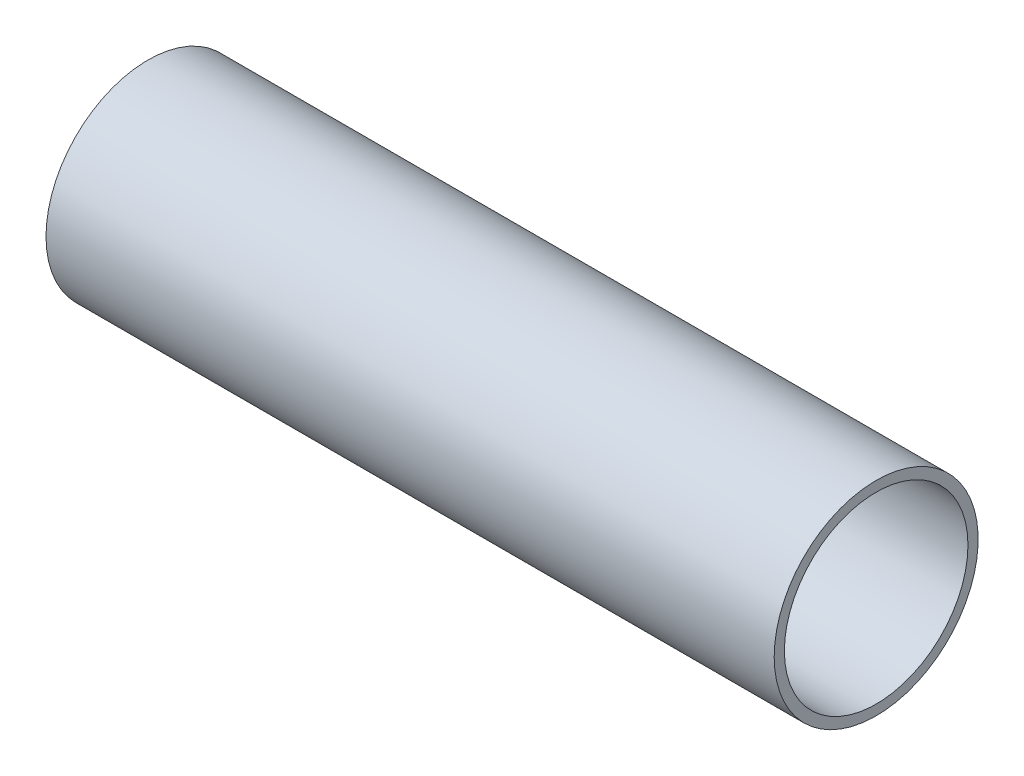
ISO-10303-21;
HEADER;
FILE_DESCRIPTION(('STEP AP214'),'2;1');
FILE_NAME('part.step','',(''),(''),'','','');
FILE_SCHEMA(('AUTOMOTIVE_DESIGN { 1 0 10303 214 1 1 1 1 }'));
ENDSEC;
DATA;
#1=APPLICATION_CONTEXT('core data for automotive mechanical design processes');
#2=APPLICATION_PROTOCOL_DEFINITION('international standard','automotive_design',2000,#1);
#3=PRODUCT_CONTEXT('',#1,'mechanical');
#4=PRODUCT('Part','Part','',(#3));
#5=PRODUCT_RELATED_PRODUCT_CATEGORY('part','',(#4));
#6=PRODUCT_DEFINITION_FORMATION('','',#4);
#7=PRODUCT_DEFINITION_CONTEXT('part definition',#1,'design');
#8=PRODUCT_DEFINITION('design','',#6,#7);
#9=PRODUCT_DEFINITION_SHAPE('','',#8);
#10=(LENGTH_UNIT() NAMED_UNIT(*) SI_UNIT(.MILLI.,.METRE.));
#11=(NAMED_UNIT(*) PLANE_ANGLE_UNIT() SI_UNIT($,.RADIAN.));
#12=(NAMED_UNIT(*) SI_UNIT($,.STERADIAN.) SOLID_ANGLE_UNIT());
#13=UNCERTAINTY_MEASURE_WITH_UNIT(LENGTH_MEASURE(1.E-05),#10,'distance_accuracy_value','');
#14=(GEOMETRIC_REPRESENTATION_CONTEXT(3) GLOBAL_UNCERTAINTY_ASSIGNED_CONTEXT((#13)) GLOBAL_UNIT_ASSIGNED_CONTEXT((#10,
#11,#12)) REPRESENTATION_CONTEXT('',''));
#15=CARTESIAN_POINT('',(0.,0.,0.));
#16=DIRECTION('',(0.,0.,1.));
#17=DIRECTION('',(1.,0.,0.));
#18=AXIS2_PLACEMENT_3D('',#15,#16,#17);
#19=CARTESIAN_POINT('',(-56.67375,0.,-14.2875));
#20=DIRECTION('',(1.,0.,0.));
#21=DIRECTION('',(0.,0.,-1.));
#22=AXIS2_PLACEMENT_3D('',#19,#20,#21);
#23=PLANE('',#22);
#24=CARTESIAN_POINT('',(-56.67375,0.,0.));
#25=DIRECTION('',(-1.,0.,0.));
#26=DIRECTION('',(0.,0.,1.));
#27=AXIS2_PLACEMENT_3D('',#24,#25,#26);
#28=CIRCLE('',#27,14.2875);
#29=CARTESIAN_POINT('',(-56.67375,0.,14.2875));
#30=VERTEX_POINT('',#29);
#31=EDGE_CURVE('E46',#30,#30,#28,.T.);
#32=ORIENTED_EDGE('',*,*,#31,.F.);
#33=EDGE_LOOP('',(#32));
#34=FACE_BOUND('',#33,.T.);
#35=CARTESIAN_POINT('',(-56.67375,0.,0.));
#36=DIRECTION('',(-1.,0.,0.));
#37=DIRECTION('',(0.,0.,1.));
#38=AXIS2_PLACEMENT_3D('',#35,#36,#37);
#39=CIRCLE('',#38,15.875);
#40=CARTESIAN_POINT('',(-56.67375,0.,15.875));
#41=VERTEX_POINT('',#40);
#42=EDGE_CURVE('E10',#41,#41,#39,.T.);
#43=ORIENTED_EDGE('',*,*,#42,.T.);
#44=EDGE_LOOP('',(#43));
#45=FACE_BOUND('',#44,.T.);
#46=ADVANCED_FACE('F32',(#34,#45),#23,.F.);
#47=CARTESIAN_POINT('',(-135.471080773702,0.,0.));
#48=DIRECTION('',(-1.,0.,0.));
#49=DIRECTION('',(0.,0.,1.));
#50=AXIS2_PLACEMENT_3D('',#47,#48,#49);
#51=CYLINDRICAL_SURFACE('',#50,15.875);
#52=ORIENTED_EDGE('',*,*,#42,.F.);
#53=EDGE_LOOP('',(#52));
#54=FACE_BOUND('',#53,.T.);
#55=CARTESIAN_POINT('',(56.67375,0.,0.));
#56=DIRECTION('',(-1.,0.,0.));
#57=DIRECTION('',(0.,0.,1.));
#58=AXIS2_PLACEMENT_3D('',#55,#56,#57);
#59=CIRCLE('',#58,15.875);
#60=CARTESIAN_POINT('',(56.67375,0.,15.875));
#61=VERTEX_POINT('',#60);
#62=EDGE_CURVE('E38',#61,#61,#59,.T.);
#63=ORIENTED_EDGE('',*,*,#62,.T.);
#64=EDGE_LOOP('',(#63));
#65=FACE_BOUND('',#64,.T.);
#66=ADVANCED_FACE('F55',(#54,#65),#51,.T.);
#67=CARTESIAN_POINT('',(56.67375,0.,-15.875));
#68=DIRECTION('',(-1.,0.,0.));
#69=DIRECTION('',(0.,0.,1.));
#70=AXIS2_PLACEMENT_3D('',#67,#68,#69);
#71=PLANE('',#70);
#72=ORIENTED_EDGE('',*,*,#62,.F.);
#73=EDGE_LOOP('',(#72));
#74=FACE_BOUND('',#73,.T.);
#75=CARTESIAN_POINT('',(56.67375,0.,0.));
#76=DIRECTION('',(-1.,0.,0.));
#77=DIRECTION('',(0.,0.,1.));
#78=AXIS2_PLACEMENT_3D('',#75,#76,#77);
#79=CIRCLE('',#78,14.2875);
#80=CARTESIAN_POINT('',(56.67375,0.,14.2875));
#81=VERTEX_POINT('',#80);
#82=EDGE_CURVE('E42',#81,#81,#79,.T.);
#83=ORIENTED_EDGE('',*,*,#82,.T.);
#84=EDGE_LOOP('',(#83));
#85=FACE_BOUND('',#84,.T.);
#86=ADVANCED_FACE('F59',(#74,#85),#71,.F.);
#87=CARTESIAN_POINT('',(-135.471080773702,0.,0.));
#88=DIRECTION('',(-1.,0.,0.));
#89=DIRECTION('',(0.,0.,1.));
#90=AXIS2_PLACEMENT_3D('',#87,#88,#89);
#91=CYLINDRICAL_SURFACE('',#90,14.2875);
#92=ORIENTED_EDGE('',*,*,#82,.F.);
#93=EDGE_LOOP('',(#92));
#94=FACE_BOUND('',#93,.T.);
#95=ORIENTED_EDGE('',*,*,#31,.T.);
#96=EDGE_LOOP('',(#95));
#97=FACE_BOUND('',#96,.T.);
#98=ADVANCED_FACE('F52',(#94,#97),#91,.F.);
#99=CLOSED_SHELL('',(#46,#66,#86,#98));
#100=MANIFOLD_SOLID_BREP('B2',#99);
#101=ADVANCED_BREP_SHAPE_REPRESENTATION('',(#18,#100),#14);
#102=SHAPE_DEFINITION_REPRESENTATION(#9,#101);
ENDSEC;
END-ISO-10303-21;
